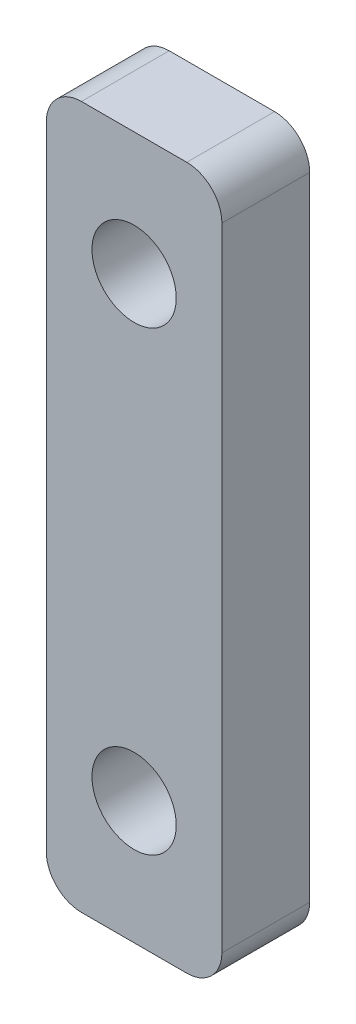
ISO-10303-21;
HEADER;
FILE_DESCRIPTION(('STEP AP214'),'2;1');
FILE_NAME('part.step','',(''),(''),'','','');
FILE_SCHEMA(('AUTOMOTIVE_DESIGN { 1 0 10303 214 1 1 1 1 }'));
ENDSEC;
DATA;
#1=APPLICATION_CONTEXT('core data for automotive mechanical design processes');
#2=APPLICATION_PROTOCOL_DEFINITION('international standard','automotive_design',2000,#1);
#3=PRODUCT_CONTEXT('',#1,'mechanical');
#4=PRODUCT('Part','Part','',(#3));
#5=PRODUCT_RELATED_PRODUCT_CATEGORY('part','',(#4));
#6=PRODUCT_DEFINITION_FORMATION('','',#4);
#7=PRODUCT_DEFINITION_CONTEXT('part definition',#1,'design');
#8=PRODUCT_DEFINITION('design','',#6,#7);
#9=PRODUCT_DEFINITION_SHAPE('','',#8);
#10=(LENGTH_UNIT() NAMED_UNIT(*) SI_UNIT(.MILLI.,.METRE.));
#11=(NAMED_UNIT(*) PLANE_ANGLE_UNIT() SI_UNIT($,.RADIAN.));
#12=(NAMED_UNIT(*) SI_UNIT($,.STERADIAN.) SOLID_ANGLE_UNIT());
#13=UNCERTAINTY_MEASURE_WITH_UNIT(LENGTH_MEASURE(1.E-05),#10,'distance_accuracy_value','');
#14=(GEOMETRIC_REPRESENTATION_CONTEXT(3) GLOBAL_UNCERTAINTY_ASSIGNED_CONTEXT((#13)) GLOBAL_UNIT_ASSIGNED_CONTEXT((#10,
#11,#12)) REPRESENTATION_CONTEXT('',''));
#15=CARTESIAN_POINT('',(0.,0.,0.));
#16=DIRECTION('',(0.,0.,1.));
#17=DIRECTION('',(1.,0.,0.));
#18=AXIS2_PLACEMENT_3D('',#15,#16,#17);
#19=CARTESIAN_POINT('',(0.,0.,5.));
#20=DIRECTION('',(0.,0.,1.));
#21=DIRECTION('',(1.,0.,0.));
#22=AXIS2_PLACEMENT_3D('',#19,#20,#21);
#23=PLANE('',#22);
#24=CARTESIAN_POINT('',(0.,13.,5.));
#25=DIRECTION('',(0.,0.,1.));
#26=DIRECTION('',(1.,0.,0.));
#27=AXIS2_PLACEMENT_3D('',#24,#25,#26);
#28=CIRCLE('',#27,2.4);
#29=CARTESIAN_POINT('',(2.4,13.,5.));
#30=VERTEX_POINT('',#29);
#31=EDGE_CURVE('E132',#30,#30,#28,.T.);
#32=ORIENTED_EDGE('',*,*,#31,.F.);
#33=EDGE_LOOP('',(#32));
#34=FACE_BOUND('',#33,.T.);
#35=DIRECTION('',(0.,1.,0.));
#36=VECTOR('',#35,1.);
#37=CARTESIAN_POINT('',(5.,20.,5.));
#38=LINE('',#37,#36);
#39=CARTESIAN_POINT('',(5.,-18.,5.));
#40=VERTEX_POINT('',#39);
#41=CARTESIAN_POINT('',(5.,18.,5.));
#42=VERTEX_POINT('',#41);
#43=EDGE_CURVE('E137',#40,#42,#38,.T.);
#44=ORIENTED_EDGE('',*,*,#43,.T.);
#45=CARTESIAN_POINT('',(3.,18.,5.));
#46=DIRECTION('',(0.,0.,1.));
#47=DIRECTION('',(1.,0.,0.));
#48=AXIS2_PLACEMENT_3D('',#45,#46,#47);
#49=CIRCLE('',#48,2.);
#50=CARTESIAN_POINT('',(3.,20.,5.));
#51=VERTEX_POINT('',#50);
#52=EDGE_CURVE('E152',#42,#51,#49,.T.);
#53=ORIENTED_EDGE('',*,*,#52,.T.);
#54=DIRECTION('',(-1.,0.,0.));
#55=VECTOR('',#54,1.);
#56=CARTESIAN_POINT('',(-5.,20.,5.));
#57=LINE('',#56,#55);
#58=CARTESIAN_POINT('',(-3.,20.,5.));
#59=VERTEX_POINT('',#58);
#60=EDGE_CURVE('E119',#51,#59,#57,.T.);
#61=ORIENTED_EDGE('',*,*,#60,.T.);
#62=CARTESIAN_POINT('',(-3.,18.,5.));
#63=DIRECTION('',(0.,0.,1.));
#64=DIRECTION('',(1.,0.,0.));
#65=AXIS2_PLACEMENT_3D('',#62,#63,#64);
#66=CIRCLE('',#65,2.);
#67=CARTESIAN_POINT('',(-5.,18.,5.));
#68=VERTEX_POINT('',#67);
#69=EDGE_CURVE('E147',#59,#68,#66,.T.);
#70=ORIENTED_EDGE('',*,*,#69,.T.);
#71=DIRECTION('',(0.,-1.,0.));
#72=VECTOR('',#71,1.);
#73=CARTESIAN_POINT('',(-5.,20.,5.));
#74=LINE('',#73,#72);
#75=CARTESIAN_POINT('',(-5.,-18.,5.));
#76=VERTEX_POINT('',#75);
#77=EDGE_CURVE('E163',#68,#76,#74,.T.);
#78=ORIENTED_EDGE('',*,*,#77,.T.);
#79=CARTESIAN_POINT('',(-3.,-18.,5.));
#80=DIRECTION('',(0.,0.,1.));
#81=DIRECTION('',(1.,0.,0.));
#82=AXIS2_PLACEMENT_3D('',#79,#80,#81);
#83=CIRCLE('',#82,2.);
#84=CARTESIAN_POINT('',(-3.,-20.,5.));
#85=VERTEX_POINT('',#84);
#86=EDGE_CURVE('E55',#76,#85,#83,.T.);
#87=ORIENTED_EDGE('',*,*,#86,.T.);
#88=DIRECTION('',(1.,0.,0.));
#89=VECTOR('',#88,1.);
#90=CARTESIAN_POINT('',(-5.,-20.,5.));
#91=LINE('',#90,#89);
#92=CARTESIAN_POINT('',(3.,-20.,5.));
#93=VERTEX_POINT('',#92);
#94=EDGE_CURVE('E138',#85,#93,#91,.T.);
#95=ORIENTED_EDGE('',*,*,#94,.T.);
#96=CARTESIAN_POINT('',(3.,-18.,5.));
#97=DIRECTION('',(0.,0.,1.));
#98=DIRECTION('',(1.,0.,0.));
#99=AXIS2_PLACEMENT_3D('',#96,#97,#98);
#100=CIRCLE('',#99,2.);
#101=EDGE_CURVE('E150',#93,#40,#100,.T.);
#102=ORIENTED_EDGE('',*,*,#101,.T.);
#103=EDGE_LOOP('',(#44,#53,#61,#70,#78,#87,#95,#102));
#104=FACE_BOUND('',#103,.T.);
#105=CARTESIAN_POINT('',(0.,-13.,5.));
#106=DIRECTION('',(0.,0.,1.));
#107=DIRECTION('',(-1.,0.,0.));
#108=AXIS2_PLACEMENT_3D('',#105,#106,#107);
#109=CIRCLE('',#108,2.4);
#110=CARTESIAN_POINT('',(-2.4,-13.,5.));
#111=VERTEX_POINT('',#110);
#112=EDGE_CURVE('E180',#111,#111,#109,.T.);
#113=ORIENTED_EDGE('',*,*,#112,.F.);
#114=EDGE_LOOP('',(#113));
#115=FACE_BOUND('',#114,.T.);
#116=ADVANCED_FACE('F33',(#34,#104,#115),#23,.T.);
#117=CARTESIAN_POINT('',(0.,0.,0.));
#118=DIRECTION('',(0.,0.,1.));
#119=DIRECTION('',(1.,0.,0.));
#120=AXIS2_PLACEMENT_3D('',#117,#118,#119);
#121=PLANE('',#120);
#122=DIRECTION('',(-1.,0.,0.));
#123=VECTOR('',#122,1.);
#124=CARTESIAN_POINT('',(-5.,20.,0.));
#125=LINE('',#124,#123);
#126=CARTESIAN_POINT('',(3.,20.,0.));
#127=VERTEX_POINT('',#126);
#128=CARTESIAN_POINT('',(-3.,20.,0.));
#129=VERTEX_POINT('',#128);
#130=EDGE_CURVE('E116',#127,#129,#125,.T.);
#131=ORIENTED_EDGE('',*,*,#130,.F.);
#132=CARTESIAN_POINT('',(3.,18.,0.));
#133=DIRECTION('',(0.,0.,1.));
#134=DIRECTION('',(1.,0.,0.));
#135=AXIS2_PLACEMENT_3D('',#132,#133,#134);
#136=CIRCLE('',#135,2.);
#137=CARTESIAN_POINT('',(5.,18.,0.));
#138=VERTEX_POINT('',#137);
#139=EDGE_CURVE('E99',#127,#138,#136,.F.);
#140=ORIENTED_EDGE('',*,*,#139,.T.);
#141=DIRECTION('',(0.,1.,0.));
#142=VECTOR('',#141,1.);
#143=CARTESIAN_POINT('',(5.,20.,0.));
#144=LINE('',#143,#142);
#145=CARTESIAN_POINT('',(5.,-18.,0.));
#146=VERTEX_POINT('',#145);
#147=EDGE_CURVE('E127',#146,#138,#144,.T.);
#148=ORIENTED_EDGE('',*,*,#147,.F.);
#149=CARTESIAN_POINT('',(3.,-18.,0.));
#150=DIRECTION('',(0.,0.,1.));
#151=DIRECTION('',(1.,0.,0.));
#152=AXIS2_PLACEMENT_3D('',#149,#150,#151);
#153=CIRCLE('',#152,2.);
#154=CARTESIAN_POINT('',(3.,-20.,0.));
#155=VERTEX_POINT('',#154);
#156=EDGE_CURVE('E110',#146,#155,#153,.F.);
#157=ORIENTED_EDGE('',*,*,#156,.T.);
#158=DIRECTION('',(1.,0.,0.));
#159=VECTOR('',#158,1.);
#160=CARTESIAN_POINT('',(-5.,-20.,0.));
#161=LINE('',#160,#159);
#162=CARTESIAN_POINT('',(-3.,-20.,0.));
#163=VERTEX_POINT('',#162);
#164=EDGE_CURVE('E130',#163,#155,#161,.T.);
#165=ORIENTED_EDGE('',*,*,#164,.F.);
#166=CARTESIAN_POINT('',(-3.,-18.,0.));
#167=DIRECTION('',(0.,0.,1.));
#168=DIRECTION('',(1.,0.,0.));
#169=AXIS2_PLACEMENT_3D('',#166,#167,#168);
#170=CIRCLE('',#169,2.);
#171=CARTESIAN_POINT('',(-5.,-18.,0.));
#172=VERTEX_POINT('',#171);
#173=EDGE_CURVE('E141',#163,#172,#170,.F.);
#174=ORIENTED_EDGE('',*,*,#173,.T.);
#175=DIRECTION('',(0.,-1.,0.));
#176=VECTOR('',#175,1.);
#177=CARTESIAN_POINT('',(-5.,20.,0.));
#178=LINE('',#177,#176);
#179=CARTESIAN_POINT('',(-5.,18.,0.));
#180=VERTEX_POINT('',#179);
#181=EDGE_CURVE('E126',#180,#172,#178,.T.);
#182=ORIENTED_EDGE('',*,*,#181,.F.);
#183=CARTESIAN_POINT('',(-3.,18.,0.));
#184=DIRECTION('',(0.,0.,1.));
#185=DIRECTION('',(1.,0.,0.));
#186=AXIS2_PLACEMENT_3D('',#183,#184,#185);
#187=CIRCLE('',#186,2.);
#188=EDGE_CURVE('E120',#180,#129,#187,.F.);
#189=ORIENTED_EDGE('',*,*,#188,.T.);
#190=EDGE_LOOP('',(#131,#140,#148,#157,#165,#174,#182,#189));
#191=FACE_BOUND('',#190,.T.);
#192=CARTESIAN_POINT('',(0.,13.,0.));
#193=DIRECTION('',(0.,0.,1.));
#194=DIRECTION('',(1.,0.,0.));
#195=AXIS2_PLACEMENT_3D('',#192,#193,#194);
#196=CIRCLE('',#195,2.4);
#197=CARTESIAN_POINT('',(2.4,13.,0.));
#198=VERTEX_POINT('',#197);
#199=EDGE_CURVE('E177',#198,#198,#196,.T.);
#200=ORIENTED_EDGE('',*,*,#199,.T.);
#201=EDGE_LOOP('',(#200));
#202=FACE_BOUND('',#201,.T.);
#203=CARTESIAN_POINT('',(0.,-13.,0.));
#204=DIRECTION('',(0.,0.,1.));
#205=DIRECTION('',(-1.,0.,0.));
#206=AXIS2_PLACEMENT_3D('',#203,#204,#205);
#207=CIRCLE('',#206,2.4);
#208=CARTESIAN_POINT('',(-2.4,-13.,0.));
#209=VERTEX_POINT('',#208);
#210=EDGE_CURVE('E183',#209,#209,#207,.T.);
#211=ORIENTED_EDGE('',*,*,#210,.T.);
#212=EDGE_LOOP('',(#211));
#213=FACE_BOUND('',#212,.T.);
#214=ADVANCED_FACE('F123',(#191,#202,#213),#121,.F.);
#215=CARTESIAN_POINT('',(5.,20.,5.));
#216=DIRECTION('',(-1.,0.,0.));
#217=DIRECTION('',(0.,0.,1.));
#218=AXIS2_PLACEMENT_3D('',#215,#216,#217);
#219=PLANE('',#218);
#220=ORIENTED_EDGE('',*,*,#147,.T.);
#221=DIRECTION('',(0.,0.,-1.));
#222=VECTOR('',#221,1.);
#223=CARTESIAN_POINT('',(5.,18.,5.));
#224=LINE('',#223,#222);
#225=EDGE_CURVE('E104',#138,#42,#224,.F.);
#226=ORIENTED_EDGE('',*,*,#225,.T.);
#227=ORIENTED_EDGE('',*,*,#43,.F.);
#228=DIRECTION('',(0.,0.,-1.));
#229=VECTOR('',#228,1.);
#230=CARTESIAN_POINT('',(5.,-18.,5.));
#231=LINE('',#230,#229);
#232=EDGE_CURVE('E109',#40,#146,#231,.T.);
#233=ORIENTED_EDGE('',*,*,#232,.T.);
#234=EDGE_LOOP('',(#220,#226,#227,#233));
#235=FACE_BOUND('',#234,.T.);
#236=ADVANCED_FACE('F198',(#235),#219,.F.);
#237=CARTESIAN_POINT('',(-5.,20.,5.));
#238=DIRECTION('',(0.,-1.,0.));
#239=DIRECTION('',(0.,0.,-1.));
#240=AXIS2_PLACEMENT_3D('',#237,#238,#239);
#241=PLANE('',#240);
#242=ORIENTED_EDGE('',*,*,#60,.F.);
#243=DIRECTION('',(0.,0.,-1.));
#244=VECTOR('',#243,1.);
#245=CARTESIAN_POINT('',(3.,20.,5.));
#246=LINE('',#245,#244);
#247=EDGE_CURVE('E103',#51,#127,#246,.T.);
#248=ORIENTED_EDGE('',*,*,#247,.T.);
#249=ORIENTED_EDGE('',*,*,#130,.T.);
#250=DIRECTION('',(0.,0.,-1.));
#251=VECTOR('',#250,1.);
#252=CARTESIAN_POINT('',(-3.,20.,5.));
#253=LINE('',#252,#251);
#254=EDGE_CURVE('E121',#129,#59,#253,.F.);
#255=ORIENTED_EDGE('',*,*,#254,.T.);
#256=EDGE_LOOP('',(#242,#248,#249,#255));
#257=FACE_BOUND('',#256,.T.);
#258=ADVANCED_FACE('F115',(#257),#241,.F.);
#259=CARTESIAN_POINT('',(-5.,20.,5.));
#260=DIRECTION('',(1.,0.,0.));
#261=DIRECTION('',(0.,0.,-1.));
#262=AXIS2_PLACEMENT_3D('',#259,#260,#261);
#263=PLANE('',#262);
#264=ORIENTED_EDGE('',*,*,#181,.T.);
#265=DIRECTION('',(0.,0.,-1.));
#266=VECTOR('',#265,1.);
#267=CARTESIAN_POINT('',(-5.,-18.,5.));
#268=LINE('',#267,#266);
#269=EDGE_CURVE('E11',#172,#76,#268,.F.);
#270=ORIENTED_EDGE('',*,*,#269,.T.);
#271=ORIENTED_EDGE('',*,*,#77,.F.);
#272=DIRECTION('',(0.,0.,-1.));
#273=VECTOR('',#272,1.);
#274=CARTESIAN_POINT('',(-5.,18.,5.));
#275=LINE('',#274,#273);
#276=EDGE_CURVE('E41',#68,#180,#275,.T.);
#277=ORIENTED_EDGE('',*,*,#276,.T.);
#278=EDGE_LOOP('',(#264,#270,#271,#277));
#279=FACE_BOUND('',#278,.T.);
#280=ADVANCED_FACE('F161',(#279),#263,.F.);
#281=CARTESIAN_POINT('',(-5.,-20.,5.));
#282=DIRECTION('',(0.,1.,0.));
#283=DIRECTION('',(0.,0.,1.));
#284=AXIS2_PLACEMENT_3D('',#281,#282,#283);
#285=PLANE('',#284);
#286=ORIENTED_EDGE('',*,*,#164,.T.);
#287=DIRECTION('',(0.,0.,-1.));
#288=VECTOR('',#287,1.);
#289=CARTESIAN_POINT('',(3.,-20.,5.));
#290=LINE('',#289,#288);
#291=EDGE_CURVE('E48',#155,#93,#290,.F.);
#292=ORIENTED_EDGE('',*,*,#291,.T.);
#293=ORIENTED_EDGE('',*,*,#94,.F.);
#294=DIRECTION('',(0.,0.,-1.));
#295=VECTOR('',#294,1.);
#296=CARTESIAN_POINT('',(-3.,-20.,5.));
#297=LINE('',#296,#295);
#298=EDGE_CURVE('E154',#85,#163,#297,.T.);
#299=ORIENTED_EDGE('',*,*,#298,.T.);
#300=EDGE_LOOP('',(#286,#292,#293,#299));
#301=FACE_BOUND('',#300,.T.);
#302=ADVANCED_FACE('F170',(#301),#285,.F.);
#303=CARTESIAN_POINT('',(0.,13.,5.));
#304=DIRECTION('',(0.,0.,-1.));
#305=DIRECTION('',(-1.,0.,0.));
#306=AXIS2_PLACEMENT_3D('',#303,#304,#305);
#307=CYLINDRICAL_SURFACE('',#306,2.4);
#308=ORIENTED_EDGE('',*,*,#31,.T.);
#309=EDGE_LOOP('',(#308));
#310=FACE_BOUND('',#309,.T.);
#311=ORIENTED_EDGE('',*,*,#199,.F.);
#312=EDGE_LOOP('',(#311));
#313=FACE_BOUND('',#312,.T.);
#314=ADVANCED_FACE('F202',(#310,#313),#307,.F.);
#315=CARTESIAN_POINT('',(0.,-13.,5.));
#316=DIRECTION('',(0.,0.,-1.));
#317=DIRECTION('',(-1.,0.,0.));
#318=AXIS2_PLACEMENT_3D('',#315,#316,#317);
#319=CYLINDRICAL_SURFACE('',#318,2.4);
#320=ORIENTED_EDGE('',*,*,#112,.T.);
#321=EDGE_LOOP('',(#320));
#322=FACE_BOUND('',#321,.T.);
#323=ORIENTED_EDGE('',*,*,#210,.F.);
#324=EDGE_LOOP('',(#323));
#325=FACE_BOUND('',#324,.T.);
#326=ADVANCED_FACE('F189',(#322,#325),#319,.F.);
#327=CARTESIAN_POINT('',(3.,18.,5.));
#328=DIRECTION('',(0.,0.,-1.));
#329=DIRECTION('',(-1.,0.,0.));
#330=AXIS2_PLACEMENT_3D('',#327,#328,#329);
#331=CYLINDRICAL_SURFACE('',#330,2.);
#332=ORIENTED_EDGE('',*,*,#52,.F.);
#333=ORIENTED_EDGE('',*,*,#225,.F.);
#334=ORIENTED_EDGE('',*,*,#139,.F.);
#335=ORIENTED_EDGE('',*,*,#247,.F.);
#336=EDGE_LOOP('',(#332,#333,#334,#335));
#337=FACE_BOUND('',#336,.T.);
#338=ADVANCED_FACE('F102',(#337),#331,.T.);
#339=CARTESIAN_POINT('',(3.,-18.,5.));
#340=DIRECTION('',(0.,0.,-1.));
#341=DIRECTION('',(-1.,0.,0.));
#342=AXIS2_PLACEMENT_3D('',#339,#340,#341);
#343=CYLINDRICAL_SURFACE('',#342,2.);
#344=ORIENTED_EDGE('',*,*,#101,.F.);
#345=ORIENTED_EDGE('',*,*,#291,.F.);
#346=ORIENTED_EDGE('',*,*,#156,.F.);
#347=ORIENTED_EDGE('',*,*,#232,.F.);
#348=EDGE_LOOP('',(#344,#345,#346,#347));
#349=FACE_BOUND('',#348,.T.);
#350=ADVANCED_FACE('F216',(#349),#343,.T.);
#351=CARTESIAN_POINT('',(-3.,-18.,5.));
#352=DIRECTION('',(0.,0.,-1.));
#353=DIRECTION('',(-1.,0.,0.));
#354=AXIS2_PLACEMENT_3D('',#351,#352,#353);
#355=CYLINDRICAL_SURFACE('',#354,2.);
#356=ORIENTED_EDGE('',*,*,#86,.F.);
#357=ORIENTED_EDGE('',*,*,#269,.F.);
#358=ORIENTED_EDGE('',*,*,#173,.F.);
#359=ORIENTED_EDGE('',*,*,#298,.F.);
#360=EDGE_LOOP('',(#356,#357,#358,#359));
#361=FACE_BOUND('',#360,.T.);
#362=ADVANCED_FACE('F169',(#361),#355,.T.);
#363=CARTESIAN_POINT('',(-3.,18.,5.));
#364=DIRECTION('',(0.,0.,-1.));
#365=DIRECTION('',(-1.,0.,0.));
#366=AXIS2_PLACEMENT_3D('',#363,#364,#365);
#367=CYLINDRICAL_SURFACE('',#366,2.);
#368=ORIENTED_EDGE('',*,*,#69,.F.);
#369=ORIENTED_EDGE('',*,*,#254,.F.);
#370=ORIENTED_EDGE('',*,*,#188,.F.);
#371=ORIENTED_EDGE('',*,*,#276,.F.);
#372=EDGE_LOOP('',(#368,#369,#370,#371));
#373=FACE_BOUND('',#372,.T.);
#374=ADVANCED_FACE('F35',(#373),#367,.T.);
#375=CLOSED_SHELL('',(#116,#214,#236,#258,#280,#302,#314,#326,#338,#350,#362,#374));
#376=MANIFOLD_SOLID_BREP('B2',#375);
#377=ADVANCED_BREP_SHAPE_REPRESENTATION('',(#18,#376),#14);
#378=SHAPE_DEFINITION_REPRESENTATION(#9,#377);
ENDSEC;
END-ISO-10303-21;
